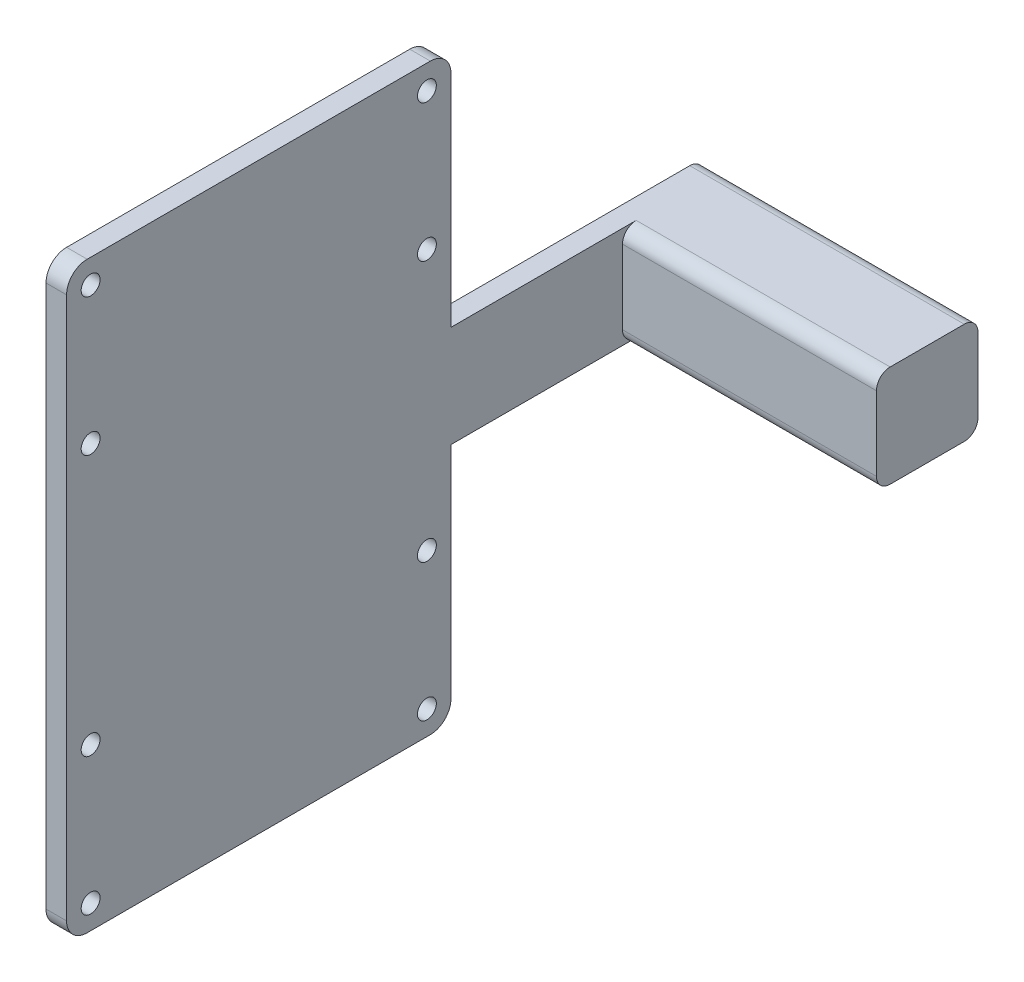
ISO-10303-21;
HEADER;
FILE_DESCRIPTION(('STEP AP214'),'2;1');
FILE_NAME('part.step','',(''),(''),'','','');
FILE_SCHEMA(('AUTOMOTIVE_DESIGN { 1 0 10303 214 1 1 1 1 }'));
ENDSEC;
DATA;
#1=APPLICATION_CONTEXT('core data for automotive mechanical design processes');
#2=APPLICATION_PROTOCOL_DEFINITION('international standard','automotive_design',2000,#1);
#3=PRODUCT_CONTEXT('',#1,'mechanical');
#4=PRODUCT('Part','Part','',(#3));
#5=PRODUCT_RELATED_PRODUCT_CATEGORY('part','',(#4));
#6=PRODUCT_DEFINITION_FORMATION('','',#4);
#7=PRODUCT_DEFINITION_CONTEXT('part definition',#1,'design');
#8=PRODUCT_DEFINITION('design','',#6,#7);
#9=PRODUCT_DEFINITION_SHAPE('','',#8);
#10=(LENGTH_UNIT() NAMED_UNIT(*) SI_UNIT(.MILLI.,.METRE.));
#11=(NAMED_UNIT(*) PLANE_ANGLE_UNIT() SI_UNIT($,.RADIAN.));
#12=(NAMED_UNIT(*) SI_UNIT($,.STERADIAN.) SOLID_ANGLE_UNIT());
#13=UNCERTAINTY_MEASURE_WITH_UNIT(LENGTH_MEASURE(1.E-05),#10,'distance_accuracy_value','');
#14=(GEOMETRIC_REPRESENTATION_CONTEXT(3) GLOBAL_UNCERTAINTY_ASSIGNED_CONTEXT((#13)) GLOBAL_UNIT_ASSIGNED_CONTEXT((#10,
#11,#12)) REPRESENTATION_CONTEXT('',''));
#15=CARTESIAN_POINT('',(0.,0.,0.));
#16=DIRECTION('',(0.,0.,1.));
#17=DIRECTION('',(1.,0.,0.));
#18=AXIS2_PLACEMENT_3D('',#15,#16,#17);
#19=CARTESIAN_POINT('',(-20.,-7.4,14.8));
#20=DIRECTION('',(1.,0.,0.));
#21=DIRECTION('',(0.,0.,-1.));
#22=AXIS2_PLACEMENT_3D('',#19,#20,#21);
#23=PLANE('',#22);
#24=CARTESIAN_POINT('',(-20.,19.,92.3));
#25=DIRECTION('',(1.,0.,0.));
#26=DIRECTION('',(0.,0.,-1.));
#27=AXIS2_PLACEMENT_3D('',#24,#25,#26);
#28=CIRCLE('',#27,1.375);
#29=CARTESIAN_POINT('',(-20.,19.,90.925));
#30=VERTEX_POINT('',#29);
#31=EDGE_CURVE('E373',#30,#30,#28,.F.);
#32=ORIENTED_EDGE('',*,*,#31,.F.);
#33=EDGE_LOOP('',(#32));
#34=FACE_BOUND('',#33,.T.);
#35=CARTESIAN_POINT('',(-20.,19.,43.3));
#36=DIRECTION('',(1.,0.,0.));
#37=DIRECTION('',(0.,0.,-1.));
#38=AXIS2_PLACEMENT_3D('',#35,#36,#37);
#39=CIRCLE('',#38,1.375);
#40=CARTESIAN_POINT('',(-20.,19.,41.925));
#41=VERTEX_POINT('',#40);
#42=EDGE_CURVE('E380',#41,#41,#39,.F.);
#43=ORIENTED_EDGE('',*,*,#42,.F.);
#44=EDGE_LOOP('',(#43));
#45=FACE_BOUND('',#44,.T.);
#46=CARTESIAN_POINT('',(-20.,-39.,43.3));
#47=DIRECTION('',(1.,0.,0.));
#48=DIRECTION('',(0.,0.,-1.));
#49=AXIS2_PLACEMENT_3D('',#46,#47,#48);
#50=CIRCLE('',#49,1.375);
#51=CARTESIAN_POINT('',(-20.,-39.,41.925));
#52=VERTEX_POINT('',#51);
#53=EDGE_CURVE('E383',#52,#52,#50,.F.);
#54=ORIENTED_EDGE('',*,*,#53,.F.);
#55=EDGE_LOOP('',(#54));
#56=FACE_BOUND('',#55,.T.);
#57=CARTESIAN_POINT('',(-20.,-39.,92.3));
#58=DIRECTION('',(1.,0.,0.));
#59=DIRECTION('',(0.,0.,-1.));
#60=AXIS2_PLACEMENT_3D('',#57,#58,#59);
#61=CIRCLE('',#60,1.375);
#62=CARTESIAN_POINT('',(-20.,-39.,90.925));
#63=VERTEX_POINT('',#62);
#64=EDGE_CURVE('E386',#63,#63,#61,.F.);
#65=ORIENTED_EDGE('',*,*,#64,.F.);
#66=EDGE_LOOP('',(#65));
#67=FACE_BOUND('',#66,.T.);
#68=CARTESIAN_POINT('',(-20.,-19.,92.3));
#69=DIRECTION('',(1.,0.,0.));
#70=DIRECTION('',(0.,0.,-1.));
#71=AXIS2_PLACEMENT_3D('',#68,#69,#70);
#72=CIRCLE('',#71,1.375);
#73=CARTESIAN_POINT('',(-20.,-19.,90.925));
#74=VERTEX_POINT('',#73);
#75=EDGE_CURVE('E353',#74,#74,#72,.T.);
#76=ORIENTED_EDGE('',*,*,#75,.T.);
#77=EDGE_LOOP('',(#76));
#78=FACE_BOUND('',#77,.T.);
#79=CARTESIAN_POINT('',(-20.,-19.,43.3));
#80=DIRECTION('',(1.,0.,0.));
#81=DIRECTION('',(0.,0.,-1.));
#82=AXIS2_PLACEMENT_3D('',#79,#80,#81);
#83=CIRCLE('',#82,1.375);
#84=CARTESIAN_POINT('',(-20.,-19.,41.925));
#85=VERTEX_POINT('',#84);
#86=EDGE_CURVE('E356',#85,#85,#83,.T.);
#87=ORIENTED_EDGE('',*,*,#86,.T.);
#88=EDGE_LOOP('',(#87));
#89=FACE_BOUND('',#88,.T.);
#90=CARTESIAN_POINT('',(-20.,39.,43.3));
#91=DIRECTION('',(1.,0.,0.));
#92=DIRECTION('',(0.,0.,-1.));
#93=AXIS2_PLACEMENT_3D('',#90,#91,#92);
#94=CIRCLE('',#93,1.375);
#95=CARTESIAN_POINT('',(-20.,39.,41.925));
#96=VERTEX_POINT('',#95);
#97=EDGE_CURVE('E359',#96,#96,#94,.T.);
#98=ORIENTED_EDGE('',*,*,#97,.T.);
#99=EDGE_LOOP('',(#98));
#100=FACE_BOUND('',#99,.T.);
#101=CARTESIAN_POINT('',(-20.,39.,92.3));
#102=DIRECTION('',(1.,0.,0.));
#103=DIRECTION('',(0.,0.,-1.));
#104=AXIS2_PLACEMENT_3D('',#101,#102,#103);
#105=CIRCLE('',#104,1.375);
#106=CARTESIAN_POINT('',(-20.,39.,90.925));
#107=VERTEX_POINT('',#106);
#108=EDGE_CURVE('E362',#107,#107,#105,.T.);
#109=ORIENTED_EDGE('',*,*,#108,.T.);
#110=EDGE_LOOP('',(#109));
#111=FACE_BOUND('',#110,.T.);
#112=DIRECTION('',(0.,0.,-1.));
#113=VECTOR('',#112,1.);
#114=CARTESIAN_POINT('',(-20.,7.4,14.8));
#115=LINE('',#114,#113);
#116=CARTESIAN_POINT('',(-20.,7.4,39.8));
#117=VERTEX_POINT('',#116);
#118=CARTESIAN_POINT('',(-20.,7.4,2.));
#119=VERTEX_POINT('',#118);
#120=EDGE_CURVE('E161',#117,#119,#115,.T.);
#121=ORIENTED_EDGE('',*,*,#120,.T.);
#122=CARTESIAN_POINT('',(-20.,5.4,2.));
#123=DIRECTION('',(1.,0.,0.));
#124=DIRECTION('',(0.,0.,-1.));
#125=AXIS2_PLACEMENT_3D('',#122,#123,#124);
#126=CIRCLE('',#125,2.);
#127=CARTESIAN_POINT('',(-20.,5.4,0.));
#128=VERTEX_POINT('',#127);
#129=EDGE_CURVE('E57',#119,#128,#126,.F.);
#130=ORIENTED_EDGE('',*,*,#129,.T.);
#131=DIRECTION('',(0.,-1.,0.));
#132=VECTOR('',#131,1.);
#133=CARTESIAN_POINT('',(-20.,-7.4,0.));
#134=LINE('',#133,#132);
#135=CARTESIAN_POINT('',(-20.,-5.4,0.));
#136=VERTEX_POINT('',#135);
#137=EDGE_CURVE('E198',#128,#136,#134,.T.);
#138=ORIENTED_EDGE('',*,*,#137,.T.);
#139=CARTESIAN_POINT('',(-20.,-5.4,2.));
#140=DIRECTION('',(1.,0.,0.));
#141=DIRECTION('',(0.,0.,-1.));
#142=AXIS2_PLACEMENT_3D('',#139,#140,#141);
#143=CIRCLE('',#142,2.);
#144=CARTESIAN_POINT('',(-20.,-7.4,2.));
#145=VERTEX_POINT('',#144);
#146=EDGE_CURVE('E270',#136,#145,#143,.F.);
#147=ORIENTED_EDGE('',*,*,#146,.T.);
#148=DIRECTION('',(0.,0.,-1.));
#149=VECTOR('',#148,1.);
#150=CARTESIAN_POINT('',(-20.,-7.4,14.8));
#151=LINE('',#150,#149);
#152=CARTESIAN_POINT('',(-20.,-7.4,39.8));
#153=VERTEX_POINT('',#152);
#154=EDGE_CURVE('E209',#153,#145,#151,.T.);
#155=ORIENTED_EDGE('',*,*,#154,.F.);
#156=DIRECTION('',(0.,-1.,0.));
#157=VECTOR('',#156,1.);
#158=CARTESIAN_POINT('',(-20.,-42.5,39.8));
#159=LINE('',#158,#157);
#160=CARTESIAN_POINT('',(-20.,-39.5,39.8));
#161=VERTEX_POINT('',#160);
#162=EDGE_CURVE('E168',#153,#161,#159,.T.);
#163=ORIENTED_EDGE('',*,*,#162,.T.);
#164=CARTESIAN_POINT('',(-20.,-39.5,42.8));
#165=DIRECTION('',(1.,0.,0.));
#166=DIRECTION('',(0.,0.,-1.));
#167=AXIS2_PLACEMENT_3D('',#164,#165,#166);
#168=CIRCLE('',#167,3.);
#169=CARTESIAN_POINT('',(-20.,-42.5,42.8));
#170=VERTEX_POINT('',#169);
#171=EDGE_CURVE('E232',#161,#170,#168,.F.);
#172=ORIENTED_EDGE('',*,*,#171,.T.);
#173=DIRECTION('',(0.,0.,-1.));
#174=VECTOR('',#173,1.);
#175=CARTESIAN_POINT('',(-20.,-42.5,95.8));
#176=LINE('',#175,#174);
#177=CARTESIAN_POINT('',(-20.,-42.5,92.8));
#178=VERTEX_POINT('',#177);
#179=EDGE_CURVE('E195',#178,#170,#176,.T.);
#180=ORIENTED_EDGE('',*,*,#179,.F.);
#181=CARTESIAN_POINT('',(-20.,-39.5,92.8));
#182=DIRECTION('',(1.,0.,0.));
#183=DIRECTION('',(0.,0.,-1.));
#184=AXIS2_PLACEMENT_3D('',#181,#182,#183);
#185=CIRCLE('',#184,3.);
#186=CARTESIAN_POINT('',(-20.,-39.5,95.8));
#187=VERTEX_POINT('',#186);
#188=EDGE_CURVE('E230',#178,#187,#185,.F.);
#189=ORIENTED_EDGE('',*,*,#188,.T.);
#190=DIRECTION('',(0.,-1.,0.));
#191=VECTOR('',#190,1.);
#192=CARTESIAN_POINT('',(-20.,-42.5,95.8));
#193=LINE('',#192,#191);
#194=CARTESIAN_POINT('',(-20.,39.5,95.8));
#195=VERTEX_POINT('',#194);
#196=EDGE_CURVE('E328',#195,#187,#193,.T.);
#197=ORIENTED_EDGE('',*,*,#196,.F.);
#198=CARTESIAN_POINT('',(-20.,39.5,92.8));
#199=DIRECTION('',(1.,0.,0.));
#200=DIRECTION('',(0.,0.,-1.));
#201=AXIS2_PLACEMENT_3D('',#198,#199,#200);
#202=CIRCLE('',#201,3.);
#203=CARTESIAN_POINT('',(-20.,42.5,92.8));
#204=VERTEX_POINT('',#203);
#205=EDGE_CURVE('E227',#195,#204,#202,.F.);
#206=ORIENTED_EDGE('',*,*,#205,.T.);
#207=DIRECTION('',(0.,0.,-1.));
#208=VECTOR('',#207,1.);
#209=CARTESIAN_POINT('',(-20.,42.5,95.8));
#210=LINE('',#209,#208);
#211=CARTESIAN_POINT('',(-20.,42.5,42.8));
#212=VERTEX_POINT('',#211);
#213=EDGE_CURVE('E319',#204,#212,#210,.T.);
#214=ORIENTED_EDGE('',*,*,#213,.T.);
#215=CARTESIAN_POINT('',(-20.,39.5,42.8));
#216=DIRECTION('',(1.,0.,0.));
#217=DIRECTION('',(0.,0.,-1.));
#218=AXIS2_PLACEMENT_3D('',#215,#216,#217);
#219=CIRCLE('',#218,3.);
#220=CARTESIAN_POINT('',(-20.,39.5,39.8));
#221=VERTEX_POINT('',#220);
#222=EDGE_CURVE('E163',#212,#221,#219,.F.);
#223=ORIENTED_EDGE('',*,*,#222,.T.);
#224=EDGE_CURVE('E159',#221,#117,#159,.T.);
#225=ORIENTED_EDGE('',*,*,#224,.T.);
#226=EDGE_LOOP('',(#121,#130,#138,#147,#155,#163,#172,#180,#189,#197,#206,#214,#223,#225));
#227=FACE_BOUND('',#226,.T.);
#228=ADVANCED_FACE('F35',(#34,#45,#56,#67,#78,#89,#100,#111,#227),#23,.F.);
#229=CARTESIAN_POINT('',(20.,-7.4,14.8));
#230=DIRECTION('',(0.,1.,0.));
#231=DIRECTION('',(-1.,0.,0.));
#232=AXIS2_PLACEMENT_3D('',#229,#230,#231);
#233=PLANE('',#232);
#234=DIRECTION('',(0.,0.,-1.));
#235=VECTOR('',#234,1.);
#236=CARTESIAN_POINT('',(20.,-7.4,14.8));
#237=LINE('',#236,#235);
#238=CARTESIAN_POINT('',(20.,-7.4,12.8));
#239=VERTEX_POINT('',#238);
#240=CARTESIAN_POINT('',(20.,-7.4,2.));
#241=VERTEX_POINT('',#240);
#242=EDGE_CURVE('E206',#239,#241,#237,.T.);
#243=ORIENTED_EDGE('',*,*,#242,.F.);
#244=DIRECTION('',(1.,0.,0.));
#245=VECTOR('',#244,1.);
#246=CARTESIAN_POINT('',(-17.,-7.4,12.8));
#247=LINE('',#246,#245);
#248=CARTESIAN_POINT('',(-17.,-7.4,12.8));
#249=VERTEX_POINT('',#248);
#250=EDGE_CURVE('E264',#239,#249,#247,.F.);
#251=ORIENTED_EDGE('',*,*,#250,.T.);
#252=DIRECTION('',(0.,0.,-1.));
#253=VECTOR('',#252,1.);
#254=CARTESIAN_POINT('',(-17.,-7.4,39.8));
#255=LINE('',#254,#253);
#256=CARTESIAN_POINT('',(-17.,-7.4,39.8));
#257=VERTEX_POINT('',#256);
#258=EDGE_CURVE('E187',#257,#249,#255,.T.);
#259=ORIENTED_EDGE('',*,*,#258,.F.);
#260=DIRECTION('',(1.,0.,0.));
#261=VECTOR('',#260,1.);
#262=CARTESIAN_POINT('',(-20.,-7.4,39.8));
#263=LINE('',#262,#261);
#264=EDGE_CURVE('E185',#153,#257,#263,.T.);
#265=ORIENTED_EDGE('',*,*,#264,.F.);
#266=ORIENTED_EDGE('',*,*,#154,.T.);
#267=DIRECTION('',(1.,0.,0.));
#268=VECTOR('',#267,1.);
#269=CARTESIAN_POINT('',(20.,-7.4,2.));
#270=LINE('',#269,#268);
#271=EDGE_CURVE('E261',#145,#241,#270,.T.);
#272=ORIENTED_EDGE('',*,*,#271,.T.);
#273=EDGE_LOOP('',(#243,#251,#259,#265,#266,#272));
#274=FACE_BOUND('',#273,.T.);
#275=ADVANCED_FACE('F293',(#274),#233,.F.);
#276=CARTESIAN_POINT('',(20.,-7.4,14.8));
#277=DIRECTION('',(-1.,0.,0.));
#278=DIRECTION('',(0.,0.,1.));
#279=AXIS2_PLACEMENT_3D('',#276,#277,#278);
#280=PLANE('',#279);
#281=DIRECTION('',(0.,1.,0.));
#282=VECTOR('',#281,1.);
#283=CARTESIAN_POINT('',(20.,-7.4,14.8));
#284=LINE('',#283,#282);
#285=CARTESIAN_POINT('',(20.,-5.4,14.8));
#286=VERTEX_POINT('',#285);
#287=CARTESIAN_POINT('',(20.,5.4,14.8));
#288=VERTEX_POINT('',#287);
#289=EDGE_CURVE('E180',#286,#288,#284,.T.);
#290=ORIENTED_EDGE('',*,*,#289,.F.);
#291=CARTESIAN_POINT('',(20.,-5.4,12.8));
#292=DIRECTION('',(-1.,0.,0.));
#293=DIRECTION('',(0.,0.,1.));
#294=AXIS2_PLACEMENT_3D('',#291,#292,#293);
#295=CIRCLE('',#294,2.);
#296=EDGE_CURVE('E259',#286,#239,#295,.F.);
#297=ORIENTED_EDGE('',*,*,#296,.T.);
#298=ORIENTED_EDGE('',*,*,#242,.T.);
#299=CARTESIAN_POINT('',(20.,-5.4,2.));
#300=DIRECTION('',(-1.,0.,0.));
#301=DIRECTION('',(0.,0.,1.));
#302=AXIS2_PLACEMENT_3D('',#299,#300,#301);
#303=CIRCLE('',#302,2.);
#304=CARTESIAN_POINT('',(20.,-5.4,0.));
#305=VERTEX_POINT('',#304);
#306=EDGE_CURVE('E253',#241,#305,#303,.F.);
#307=ORIENTED_EDGE('',*,*,#306,.T.);
#308=DIRECTION('',(0.,1.,0.));
#309=VECTOR('',#308,1.);
#310=CARTESIAN_POINT('',(20.,-7.4,0.));
#311=LINE('',#310,#309);
#312=CARTESIAN_POINT('',(20.,5.4,0.));
#313=VERTEX_POINT('',#312);
#314=EDGE_CURVE('E201',#305,#313,#311,.T.);
#315=ORIENTED_EDGE('',*,*,#314,.T.);
#316=CARTESIAN_POINT('',(20.,5.4,2.));
#317=DIRECTION('',(-1.,0.,0.));
#318=DIRECTION('',(0.,0.,1.));
#319=AXIS2_PLACEMENT_3D('',#316,#317,#318);
#320=CIRCLE('',#319,2.);
#321=CARTESIAN_POINT('',(20.,7.4,2.));
#322=VERTEX_POINT('',#321);
#323=EDGE_CURVE('E255',#313,#322,#320,.F.);
#324=ORIENTED_EDGE('',*,*,#323,.T.);
#325=DIRECTION('',(0.,0.,-1.));
#326=VECTOR('',#325,1.);
#327=CARTESIAN_POINT('',(20.,7.4,14.8));
#328=LINE('',#327,#326);
#329=CARTESIAN_POINT('',(20.,7.4,12.8));
#330=VERTEX_POINT('',#329);
#331=EDGE_CURVE('E179',#330,#322,#328,.T.);
#332=ORIENTED_EDGE('',*,*,#331,.F.);
#333=CARTESIAN_POINT('',(20.,5.4,12.8));
#334=DIRECTION('',(-1.,0.,0.));
#335=DIRECTION('',(0.,0.,1.));
#336=AXIS2_PLACEMENT_3D('',#333,#334,#335);
#337=CIRCLE('',#336,2.);
#338=EDGE_CURVE('E257',#330,#288,#337,.F.);
#339=ORIENTED_EDGE('',*,*,#338,.T.);
#340=EDGE_LOOP('',(#290,#297,#298,#307,#315,#324,#332,#339));
#341=FACE_BOUND('',#340,.T.);
#342=ADVANCED_FACE('F291',(#341),#280,.F.);
#343=CARTESIAN_POINT('',(20.,7.4,14.8));
#344=DIRECTION('',(0.,-1.,0.));
#345=DIRECTION('',(1.,0.,0.));
#346=AXIS2_PLACEMENT_3D('',#343,#344,#345);
#347=PLANE('',#346);
#348=DIRECTION('',(0.,0.,-1.));
#349=VECTOR('',#348,1.);
#350=CARTESIAN_POINT('',(-17.,7.4,39.8));
#351=LINE('',#350,#349);
#352=CARTESIAN_POINT('',(-17.,7.4,39.8));
#353=VERTEX_POINT('',#352);
#354=CARTESIAN_POINT('',(-17.,7.4,12.8));
#355=VERTEX_POINT('',#354);
#356=EDGE_CURVE('E184',#353,#355,#351,.T.);
#357=ORIENTED_EDGE('',*,*,#356,.T.);
#358=DIRECTION('',(-1.,0.,0.));
#359=VECTOR('',#358,1.);
#360=CARTESIAN_POINT('',(20.,7.4,12.8));
#361=LINE('',#360,#359);
#362=EDGE_CURVE('E268',#355,#330,#361,.F.);
#363=ORIENTED_EDGE('',*,*,#362,.T.);
#364=ORIENTED_EDGE('',*,*,#331,.T.);
#365=DIRECTION('',(-1.,0.,0.));
#366=VECTOR('',#365,1.);
#367=CARTESIAN_POINT('',(20.,7.4,2.));
#368=LINE('',#367,#366);
#369=EDGE_CURVE('E178',#322,#119,#368,.T.);
#370=ORIENTED_EDGE('',*,*,#369,.T.);
#371=ORIENTED_EDGE('',*,*,#120,.F.);
#372=DIRECTION('',(-1.,0.,0.));
#373=VECTOR('',#372,1.);
#374=CARTESIAN_POINT('',(-20.,7.4,39.8));
#375=LINE('',#374,#373);
#376=EDGE_CURVE('E174',#353,#117,#375,.T.);
#377=ORIENTED_EDGE('',*,*,#376,.F.);
#378=EDGE_LOOP('',(#357,#363,#364,#370,#371,#377));
#379=FACE_BOUND('',#378,.T.);
#380=ADVANCED_FACE('F173',(#379),#347,.F.);
#381=CARTESIAN_POINT('',(0.,0.,14.8));
#382=DIRECTION('',(0.,0.,1.));
#383=DIRECTION('',(1.,0.,0.));
#384=AXIS2_PLACEMENT_3D('',#381,#382,#383);
#385=PLANE('',#384);
#386=DIRECTION('',(0.,1.,0.));
#387=VECTOR('',#386,1.);
#388=CARTESIAN_POINT('',(-17.,7.4,14.8));
#389=LINE('',#388,#387);
#390=CARTESIAN_POINT('',(-17.,-5.4,14.8));
#391=VERTEX_POINT('',#390);
#392=CARTESIAN_POINT('',(-17.,5.4,14.8));
#393=VERTEX_POINT('',#392);
#394=EDGE_CURVE('E190',#391,#393,#389,.T.);
#395=ORIENTED_EDGE('',*,*,#394,.F.);
#396=DIRECTION('',(1.,0.,0.));
#397=VECTOR('',#396,1.);
#398=CARTESIAN_POINT('',(20.,-5.4,14.8));
#399=LINE('',#398,#397);
#400=EDGE_CURVE('E250',#391,#286,#399,.T.);
#401=ORIENTED_EDGE('',*,*,#400,.T.);
#402=ORIENTED_EDGE('',*,*,#289,.T.);
#403=DIRECTION('',(-1.,0.,0.));
#404=VECTOR('',#403,1.);
#405=CARTESIAN_POINT('',(-17.,5.4,14.8));
#406=LINE('',#405,#404);
#407=EDGE_CURVE('E247',#288,#393,#406,.T.);
#408=ORIENTED_EDGE('',*,*,#407,.T.);
#409=EDGE_LOOP('',(#395,#401,#402,#408));
#410=FACE_BOUND('',#409,.T.);
#411=ADVANCED_FACE('F285',(#410),#385,.T.);
#412=CARTESIAN_POINT('',(0.,0.,0.));
#413=DIRECTION('',(0.,0.,1.));
#414=DIRECTION('',(1.,0.,0.));
#415=AXIS2_PLACEMENT_3D('',#412,#413,#414);
#416=PLANE('',#415);
#417=ORIENTED_EDGE('',*,*,#137,.F.);
#418=DIRECTION('',(-1.,0.,0.));
#419=VECTOR('',#418,1.);
#420=CARTESIAN_POINT('',(0.,5.4,0.));
#421=LINE('',#420,#419);
#422=EDGE_CURVE('E274',#128,#313,#421,.F.);
#423=ORIENTED_EDGE('',*,*,#422,.T.);
#424=ORIENTED_EDGE('',*,*,#314,.F.);
#425=DIRECTION('',(1.,0.,0.));
#426=VECTOR('',#425,1.);
#427=CARTESIAN_POINT('',(0.,-5.4,0.));
#428=LINE('',#427,#426);
#429=EDGE_CURVE('E50',#305,#136,#428,.F.);
#430=ORIENTED_EDGE('',*,*,#429,.T.);
#431=EDGE_LOOP('',(#417,#423,#424,#430));
#432=FACE_BOUND('',#431,.T.);
#433=ADVANCED_FACE('F299',(#432),#416,.F.);
#434=CARTESIAN_POINT('',(-17.,7.4,39.8));
#435=DIRECTION('',(-1.,0.,0.));
#436=DIRECTION('',(0.,-1.,0.));
#437=AXIS2_PLACEMENT_3D('',#434,#435,#436);
#438=PLANE('',#437);
#439=CARTESIAN_POINT('',(-17.,19.,92.3));
#440=DIRECTION('',(-1.,0.,0.));
#441=DIRECTION('',(0.,-1.,0.));
#442=AXIS2_PLACEMENT_3D('',#439,#440,#441);
#443=CIRCLE('',#442,1.375);
#444=CARTESIAN_POINT('',(-17.,17.625,92.3));
#445=VERTEX_POINT('',#444);
#446=EDGE_CURVE('E393',#445,#445,#443,.T.);
#447=ORIENTED_EDGE('',*,*,#446,.T.);
#448=EDGE_LOOP('',(#447));
#449=FACE_BOUND('',#448,.T.);
#450=CARTESIAN_POINT('',(-17.,19.,43.3));
#451=DIRECTION('',(-1.,0.,0.));
#452=DIRECTION('',(0.,-1.,0.));
#453=AXIS2_PLACEMENT_3D('',#450,#451,#452);
#454=CIRCLE('',#453,1.375);
#455=CARTESIAN_POINT('',(-17.,17.625,43.3));
#456=VERTEX_POINT('',#455);
#457=EDGE_CURVE('E396',#456,#456,#454,.T.);
#458=ORIENTED_EDGE('',*,*,#457,.T.);
#459=EDGE_LOOP('',(#458));
#460=FACE_BOUND('',#459,.T.);
#461=CARTESIAN_POINT('',(-17.,-39.,43.3));
#462=DIRECTION('',(-1.,0.,0.));
#463=DIRECTION('',(0.,-1.,0.));
#464=AXIS2_PLACEMENT_3D('',#461,#462,#463);
#465=CIRCLE('',#464,1.375);
#466=CARTESIAN_POINT('',(-17.,-40.375,43.3));
#467=VERTEX_POINT('',#466);
#468=EDGE_CURVE('E392',#467,#467,#465,.T.);
#469=ORIENTED_EDGE('',*,*,#468,.T.);
#470=EDGE_LOOP('',(#469));
#471=FACE_BOUND('',#470,.T.);
#472=CARTESIAN_POINT('',(-17.,-39.,92.3));
#473=DIRECTION('',(-1.,0.,0.));
#474=DIRECTION('',(0.,-1.,0.));
#475=AXIS2_PLACEMENT_3D('',#472,#473,#474);
#476=CIRCLE('',#475,1.375);
#477=CARTESIAN_POINT('',(-17.,-40.375,92.3));
#478=VERTEX_POINT('',#477);
#479=EDGE_CURVE('E389',#478,#478,#476,.T.);
#480=ORIENTED_EDGE('',*,*,#479,.T.);
#481=EDGE_LOOP('',(#480));
#482=FACE_BOUND('',#481,.T.);
#483=CARTESIAN_POINT('',(-17.,-19.,92.3));
#484=DIRECTION('',(1.,0.,0.));
#485=DIRECTION('',(0.,1.,0.));
#486=AXIS2_PLACEMENT_3D('',#483,#484,#485);
#487=CIRCLE('',#486,1.375);
#488=CARTESIAN_POINT('',(-17.,-17.625,92.3));
#489=VERTEX_POINT('',#488);
#490=EDGE_CURVE('E369',#489,#489,#487,.T.);
#491=ORIENTED_EDGE('',*,*,#490,.F.);
#492=EDGE_LOOP('',(#491));
#493=FACE_BOUND('',#492,.T.);
#494=CARTESIAN_POINT('',(-17.,-19.,43.3));
#495=DIRECTION('',(1.,0.,0.));
#496=DIRECTION('',(0.,1.,0.));
#497=AXIS2_PLACEMENT_3D('',#494,#495,#496);
#498=CIRCLE('',#497,1.375);
#499=CARTESIAN_POINT('',(-17.,-17.625,43.3));
#500=VERTEX_POINT('',#499);
#501=EDGE_CURVE('E372',#500,#500,#498,.T.);
#502=ORIENTED_EDGE('',*,*,#501,.F.);
#503=EDGE_LOOP('',(#502));
#504=FACE_BOUND('',#503,.T.);
#505=CARTESIAN_POINT('',(-17.,39.,43.3));
#506=DIRECTION('',(1.,0.,0.));
#507=DIRECTION('',(0.,1.,0.));
#508=AXIS2_PLACEMENT_3D('',#505,#506,#507);
#509=CIRCLE('',#508,1.375);
#510=CARTESIAN_POINT('',(-17.,40.375,43.3));
#511=VERTEX_POINT('',#510);
#512=EDGE_CURVE('E368',#511,#511,#509,.T.);
#513=ORIENTED_EDGE('',*,*,#512,.F.);
#514=EDGE_LOOP('',(#513));
#515=FACE_BOUND('',#514,.T.);
#516=CARTESIAN_POINT('',(-17.,39.,92.3));
#517=DIRECTION('',(1.,0.,0.));
#518=DIRECTION('',(0.,1.,0.));
#519=AXIS2_PLACEMENT_3D('',#516,#517,#518);
#520=CIRCLE('',#519,1.375);
#521=CARTESIAN_POINT('',(-17.,40.375,92.3));
#522=VERTEX_POINT('',#521);
#523=EDGE_CURVE('E365',#522,#522,#520,.T.);
#524=ORIENTED_EDGE('',*,*,#523,.F.);
#525=EDGE_LOOP('',(#524));
#526=FACE_BOUND('',#525,.T.);
#527=DIRECTION('',(0.,0.,-1.));
#528=VECTOR('',#527,1.);
#529=CARTESIAN_POINT('',(-17.,-42.5,95.8));
#530=LINE('',#529,#528);
#531=CARTESIAN_POINT('',(-17.,-42.5,92.8));
#532=VERTEX_POINT('',#531);
#533=CARTESIAN_POINT('',(-17.,-42.5,42.8));
#534=VERTEX_POINT('',#533);
#535=EDGE_CURVE('E325',#532,#534,#530,.T.);
#536=ORIENTED_EDGE('',*,*,#535,.T.);
#537=CARTESIAN_POINT('',(-17.,-39.5,42.8));
#538=DIRECTION('',(-1.,0.,0.));
#539=DIRECTION('',(0.,-1.,0.));
#540=AXIS2_PLACEMENT_3D('',#537,#538,#539);
#541=CIRCLE('',#540,3.);
#542=CARTESIAN_POINT('',(-17.,-39.5,39.8));
#543=VERTEX_POINT('',#542);
#544=EDGE_CURVE('E223',#534,#543,#541,.F.);
#545=ORIENTED_EDGE('',*,*,#544,.T.);
#546=DIRECTION('',(0.,1.,0.));
#547=VECTOR('',#546,1.);
#548=CARTESIAN_POINT('',(-17.,-42.5,39.8));
#549=LINE('',#548,#547);
#550=EDGE_CURVE('E311',#543,#257,#549,.T.);
#551=ORIENTED_EDGE('',*,*,#550,.T.);
#552=ORIENTED_EDGE('',*,*,#258,.T.);
#553=CARTESIAN_POINT('',(-17.,-5.4,12.8));
#554=DIRECTION('',(-1.,0.,0.));
#555=DIRECTION('',(0.,-1.,0.));
#556=AXIS2_PLACEMENT_3D('',#553,#554,#555);
#557=CIRCLE('',#556,2.);
#558=EDGE_CURVE('E43',#249,#391,#557,.T.);
#559=ORIENTED_EDGE('',*,*,#558,.T.);
#560=ORIENTED_EDGE('',*,*,#394,.T.);
#561=CARTESIAN_POINT('',(-17.,5.4,12.8));
#562=DIRECTION('',(-1.,0.,0.));
#563=DIRECTION('',(0.,-1.,0.));
#564=AXIS2_PLACEMENT_3D('',#561,#562,#563);
#565=CIRCLE('',#564,2.);
#566=EDGE_CURVE('E11',#393,#355,#565,.T.);
#567=ORIENTED_EDGE('',*,*,#566,.T.);
#568=ORIENTED_EDGE('',*,*,#356,.F.);
#569=CARTESIAN_POINT('',(-17.,39.5,39.8));
#570=VERTEX_POINT('',#569);
#571=EDGE_CURVE('E167',#353,#570,#549,.T.);
#572=ORIENTED_EDGE('',*,*,#571,.T.);
#573=CARTESIAN_POINT('',(-17.,39.5,42.8));
#574=DIRECTION('',(-1.,0.,0.));
#575=DIRECTION('',(0.,-1.,0.));
#576=AXIS2_PLACEMENT_3D('',#573,#574,#575);
#577=CIRCLE('',#576,3.);
#578=CARTESIAN_POINT('',(-17.,42.5,42.8));
#579=VERTEX_POINT('',#578);
#580=EDGE_CURVE('E219',#570,#579,#577,.F.);
#581=ORIENTED_EDGE('',*,*,#580,.T.);
#582=DIRECTION('',(0.,0.,-1.));
#583=VECTOR('',#582,1.);
#584=CARTESIAN_POINT('',(-17.,42.5,95.8));
#585=LINE('',#584,#583);
#586=CARTESIAN_POINT('',(-17.,42.5,92.8));
#587=VERTEX_POINT('',#586);
#588=EDGE_CURVE('E321',#587,#579,#585,.T.);
#589=ORIENTED_EDGE('',*,*,#588,.F.);
#590=CARTESIAN_POINT('',(-17.,39.5,92.8));
#591=DIRECTION('',(-1.,0.,0.));
#592=DIRECTION('',(0.,-1.,0.));
#593=AXIS2_PLACEMENT_3D('',#590,#591,#592);
#594=CIRCLE('',#593,3.);
#595=CARTESIAN_POINT('',(-17.,39.5,95.8));
#596=VERTEX_POINT('',#595);
#597=EDGE_CURVE('E217',#587,#596,#594,.F.);
#598=ORIENTED_EDGE('',*,*,#597,.T.);
#599=DIRECTION('',(0.,1.,0.));
#600=VECTOR('',#599,1.);
#601=CARTESIAN_POINT('',(-17.,-42.5,95.8));
#602=LINE('',#601,#600);
#603=CARTESIAN_POINT('',(-17.,-39.5,95.8));
#604=VERTEX_POINT('',#603);
#605=EDGE_CURVE('E323',#604,#596,#602,.T.);
#606=ORIENTED_EDGE('',*,*,#605,.F.);
#607=CARTESIAN_POINT('',(-17.,-39.5,92.8));
#608=DIRECTION('',(-1.,0.,0.));
#609=DIRECTION('',(0.,-1.,0.));
#610=AXIS2_PLACEMENT_3D('',#607,#608,#609);
#611=CIRCLE('',#610,3.);
#612=EDGE_CURVE('E221',#604,#532,#611,.F.);
#613=ORIENTED_EDGE('',*,*,#612,.T.);
#614=EDGE_LOOP('',(#536,#545,#551,#552,#559,#560,#567,#568,#572,#581,#589,#598,#606,#613));
#615=FACE_BOUND('',#614,.T.);
#616=ADVANCED_FACE('F279',(#449,#460,#471,#482,#493,#504,#515,#526,#615),#438,.F.);
#617=CARTESIAN_POINT('',(0.,0.,39.8));
#618=DIRECTION('',(0.,0.,-1.));
#619=DIRECTION('',(-1.,0.,0.));
#620=AXIS2_PLACEMENT_3D('',#617,#618,#619);
#621=PLANE('',#620);
#622=ORIENTED_EDGE('',*,*,#550,.F.);
#623=DIRECTION('',(1.,0.,0.));
#624=VECTOR('',#623,1.);
#625=CARTESIAN_POINT('',(-20.,-39.5,39.8));
#626=LINE('',#625,#624);
#627=EDGE_CURVE('E225',#543,#161,#626,.F.);
#628=ORIENTED_EDGE('',*,*,#627,.T.);
#629=ORIENTED_EDGE('',*,*,#162,.F.);
#630=ORIENTED_EDGE('',*,*,#264,.T.);
#631=EDGE_LOOP('',(#622,#628,#629,#630));
#632=FACE_BOUND('',#631,.T.);
#633=ADVANCED_FACE('F345',(#632),#621,.T.);
#634=CARTESIAN_POINT('',(-20.,-42.5,95.8));
#635=DIRECTION('',(0.,1.,0.));
#636=DIRECTION('',(0.,0.,1.));
#637=AXIS2_PLACEMENT_3D('',#634,#635,#636);
#638=PLANE('',#637);
#639=ORIENTED_EDGE('',*,*,#179,.T.);
#640=DIRECTION('',(1.,0.,0.));
#641=VECTOR('',#640,1.);
#642=CARTESIAN_POINT('',(-17.,-42.5,42.8));
#643=LINE('',#642,#641);
#644=EDGE_CURVE('E214',#170,#534,#643,.T.);
#645=ORIENTED_EDGE('',*,*,#644,.T.);
#646=ORIENTED_EDGE('',*,*,#535,.F.);
#647=DIRECTION('',(1.,0.,0.));
#648=VECTOR('',#647,1.);
#649=CARTESIAN_POINT('',(-20.,-42.5,92.8));
#650=LINE('',#649,#648);
#651=EDGE_CURVE('E212',#532,#178,#650,.F.);
#652=ORIENTED_EDGE('',*,*,#651,.T.);
#653=EDGE_LOOP('',(#639,#645,#646,#652));
#654=FACE_BOUND('',#653,.T.);
#655=ADVANCED_FACE('F335',(#654),#638,.F.);
#656=CARTESIAN_POINT('',(-20.,42.5,95.8));
#657=DIRECTION('',(0.,-1.,0.));
#658=DIRECTION('',(0.,0.,-1.));
#659=AXIS2_PLACEMENT_3D('',#656,#657,#658);
#660=PLANE('',#659);
#661=ORIENTED_EDGE('',*,*,#588,.T.);
#662=DIRECTION('',(-1.,0.,0.));
#663=VECTOR('',#662,1.);
#664=CARTESIAN_POINT('',(-20.,42.5,42.8));
#665=LINE('',#664,#663);
#666=EDGE_CURVE('E242',#579,#212,#665,.T.);
#667=ORIENTED_EDGE('',*,*,#666,.T.);
#668=ORIENTED_EDGE('',*,*,#213,.F.);
#669=DIRECTION('',(-1.,0.,0.));
#670=VECTOR('',#669,1.);
#671=CARTESIAN_POINT('',(-20.,42.5,92.8));
#672=LINE('',#671,#670);
#673=EDGE_CURVE('E240',#204,#587,#672,.F.);
#674=ORIENTED_EDGE('',*,*,#673,.T.);
#675=EDGE_LOOP('',(#661,#667,#668,#674));
#676=FACE_BOUND('',#675,.T.);
#677=ADVANCED_FACE('F318',(#676),#660,.F.);
#678=CARTESIAN_POINT('',(0.,0.,95.8));
#679=DIRECTION('',(0.,0.,-1.));
#680=DIRECTION('',(-1.,0.,0.));
#681=AXIS2_PLACEMENT_3D('',#678,#679,#680);
#682=PLANE('',#681);
#683=ORIENTED_EDGE('',*,*,#196,.T.);
#684=DIRECTION('',(1.,0.,0.));
#685=VECTOR('',#684,1.);
#686=CARTESIAN_POINT('',(0.,-39.5,95.8));
#687=LINE('',#686,#685);
#688=EDGE_CURVE('E237',#187,#604,#687,.T.);
#689=ORIENTED_EDGE('',*,*,#688,.T.);
#690=ORIENTED_EDGE('',*,*,#605,.T.);
#691=DIRECTION('',(-1.,0.,0.));
#692=VECTOR('',#691,1.);
#693=CARTESIAN_POINT('',(0.,39.5,95.8));
#694=LINE('',#693,#692);
#695=EDGE_CURVE('E234',#596,#195,#694,.T.);
#696=ORIENTED_EDGE('',*,*,#695,.T.);
#697=EDGE_LOOP('',(#683,#689,#690,#696));
#698=FACE_BOUND('',#697,.T.);
#699=ADVANCED_FACE('F438',(#698),#682,.F.);
#700=ORIENTED_EDGE('',*,*,#224,.F.);
#701=DIRECTION('',(-1.,0.,0.));
#702=VECTOR('',#701,1.);
#703=CARTESIAN_POINT('',(-17.,39.5,39.8));
#704=LINE('',#703,#702);
#705=EDGE_CURVE('E245',#221,#570,#704,.F.);
#706=ORIENTED_EDGE('',*,*,#705,.T.);
#707=ORIENTED_EDGE('',*,*,#571,.F.);
#708=ORIENTED_EDGE('',*,*,#376,.T.);
#709=EDGE_LOOP('',(#700,#706,#707,#708));
#710=FACE_BOUND('',#709,.T.);
#711=ADVANCED_FACE('F182',(#710),#621,.T.);
#712=CARTESIAN_POINT('',(-22.,39.,92.3));
#713=DIRECTION('',(1.,0.,0.));
#714=DIRECTION('',(0.,1.,0.));
#715=AXIS2_PLACEMENT_3D('',#712,#713,#714);
#716=CYLINDRICAL_SURFACE('',#715,1.375);
#717=ORIENTED_EDGE('',*,*,#523,.T.);
#718=EDGE_LOOP('',(#717));
#719=FACE_BOUND('',#718,.T.);
#720=ORIENTED_EDGE('',*,*,#108,.F.);
#721=EDGE_LOOP('',(#720));
#722=FACE_BOUND('',#721,.T.);
#723=ADVANCED_FACE('F426',(#719,#722),#716,.F.);
#724=CARTESIAN_POINT('',(-22.,39.,43.3));
#725=DIRECTION('',(1.,0.,0.));
#726=DIRECTION('',(0.,1.,0.));
#727=AXIS2_PLACEMENT_3D('',#724,#725,#726);
#728=CYLINDRICAL_SURFACE('',#727,1.375);
#729=ORIENTED_EDGE('',*,*,#512,.T.);
#730=EDGE_LOOP('',(#729));
#731=FACE_BOUND('',#730,.T.);
#732=ORIENTED_EDGE('',*,*,#97,.F.);
#733=EDGE_LOOP('',(#732));
#734=FACE_BOUND('',#733,.T.);
#735=ADVANCED_FACE('F428',(#731,#734),#728,.F.);
#736=CARTESIAN_POINT('',(-22.,-19.,43.3));
#737=DIRECTION('',(1.,0.,0.));
#738=DIRECTION('',(0.,1.,0.));
#739=AXIS2_PLACEMENT_3D('',#736,#737,#738);
#740=CYLINDRICAL_SURFACE('',#739,1.375);
#741=ORIENTED_EDGE('',*,*,#501,.T.);
#742=EDGE_LOOP('',(#741));
#743=FACE_BOUND('',#742,.T.);
#744=ORIENTED_EDGE('',*,*,#86,.F.);
#745=EDGE_LOOP('',(#744));
#746=FACE_BOUND('',#745,.T.);
#747=ADVANCED_FACE('F435',(#743,#746),#740,.F.);
#748=CARTESIAN_POINT('',(-22.,-19.,92.3));
#749=DIRECTION('',(1.,0.,0.));
#750=DIRECTION('',(0.,1.,0.));
#751=AXIS2_PLACEMENT_3D('',#748,#749,#750);
#752=CYLINDRICAL_SURFACE('',#751,1.375);
#753=ORIENTED_EDGE('',*,*,#490,.T.);
#754=EDGE_LOOP('',(#753));
#755=FACE_BOUND('',#754,.T.);
#756=ORIENTED_EDGE('',*,*,#75,.F.);
#757=EDGE_LOOP('',(#756));
#758=FACE_BOUND('',#757,.T.);
#759=ADVANCED_FACE('F442',(#755,#758),#752,.F.);
#760=CARTESIAN_POINT('',(-20.,-39.5,42.8));
#761=DIRECTION('',(-1.,0.,0.));
#762=DIRECTION('',(0.,0.,1.));
#763=AXIS2_PLACEMENT_3D('',#760,#761,#762);
#764=CYLINDRICAL_SURFACE('',#763,3.);
#765=ORIENTED_EDGE('',*,*,#171,.F.);
#766=ORIENTED_EDGE('',*,*,#627,.F.);
#767=ORIENTED_EDGE('',*,*,#544,.F.);
#768=ORIENTED_EDGE('',*,*,#644,.F.);
#769=EDGE_LOOP('',(#765,#766,#767,#768));
#770=FACE_BOUND('',#769,.T.);
#771=ADVANCED_FACE('F341',(#770),#764,.T.);
#772=CARTESIAN_POINT('',(0.,-39.5,92.8));
#773=DIRECTION('',(1.,0.,0.));
#774=DIRECTION('',(0.,0.,-1.));
#775=AXIS2_PLACEMENT_3D('',#772,#773,#774);
#776=CYLINDRICAL_SURFACE('',#775,3.);
#777=ORIENTED_EDGE('',*,*,#188,.F.);
#778=ORIENTED_EDGE('',*,*,#651,.F.);
#779=ORIENTED_EDGE('',*,*,#612,.F.);
#780=ORIENTED_EDGE('',*,*,#688,.F.);
#781=EDGE_LOOP('',(#777,#778,#779,#780));
#782=FACE_BOUND('',#781,.T.);
#783=ADVANCED_FACE('F465',(#782),#776,.T.);
#784=CARTESIAN_POINT('',(-20.,39.5,42.8));
#785=DIRECTION('',(1.,0.,0.));
#786=DIRECTION('',(0.,0.,-1.));
#787=AXIS2_PLACEMENT_3D('',#784,#785,#786);
#788=CYLINDRICAL_SURFACE('',#787,3.);
#789=ORIENTED_EDGE('',*,*,#580,.F.);
#790=ORIENTED_EDGE('',*,*,#705,.F.);
#791=ORIENTED_EDGE('',*,*,#222,.F.);
#792=ORIENTED_EDGE('',*,*,#666,.F.);
#793=EDGE_LOOP('',(#789,#790,#791,#792));
#794=FACE_BOUND('',#793,.T.);
#795=ADVANCED_FACE('F315',(#794),#788,.T.);
#796=CARTESIAN_POINT('',(0.,39.5,92.8));
#797=DIRECTION('',(-1.,0.,0.));
#798=DIRECTION('',(0.,0.,1.));
#799=AXIS2_PLACEMENT_3D('',#796,#797,#798);
#800=CYLINDRICAL_SURFACE('',#799,3.);
#801=ORIENTED_EDGE('',*,*,#597,.F.);
#802=ORIENTED_EDGE('',*,*,#673,.F.);
#803=ORIENTED_EDGE('',*,*,#205,.F.);
#804=ORIENTED_EDGE('',*,*,#695,.F.);
#805=EDGE_LOOP('',(#801,#802,#803,#804));
#806=FACE_BOUND('',#805,.T.);
#807=ADVANCED_FACE('F471',(#806),#800,.T.);
#808=CARTESIAN_POINT('',(-22.,-39.,92.3));
#809=DIRECTION('',(1.,0.,0.));
#810=DIRECTION('',(0.,1.,0.));
#811=AXIS2_PLACEMENT_3D('',#808,#809,#810);
#812=CYLINDRICAL_SURFACE('',#811,1.375);
#813=ORIENTED_EDGE('',*,*,#479,.F.);
#814=EDGE_LOOP('',(#813));
#815=FACE_BOUND('',#814,.T.);
#816=ORIENTED_EDGE('',*,*,#64,.T.);
#817=EDGE_LOOP('',(#816));
#818=FACE_BOUND('',#817,.T.);
#819=ADVANCED_FACE('F408',(#815,#818),#812,.F.);
#820=CARTESIAN_POINT('',(-22.,-39.,43.3));
#821=DIRECTION('',(1.,0.,0.));
#822=DIRECTION('',(0.,1.,0.));
#823=AXIS2_PLACEMENT_3D('',#820,#821,#822);
#824=CYLINDRICAL_SURFACE('',#823,1.375);
#825=ORIENTED_EDGE('',*,*,#468,.F.);
#826=EDGE_LOOP('',(#825));
#827=FACE_BOUND('',#826,.T.);
#828=ORIENTED_EDGE('',*,*,#53,.T.);
#829=EDGE_LOOP('',(#828));
#830=FACE_BOUND('',#829,.T.);
#831=ADVANCED_FACE('F404',(#827,#830),#824,.F.);
#832=CARTESIAN_POINT('',(-22.,19.,43.3));
#833=DIRECTION('',(1.,0.,0.));
#834=DIRECTION('',(0.,1.,0.));
#835=AXIS2_PLACEMENT_3D('',#832,#833,#834);
#836=CYLINDRICAL_SURFACE('',#835,1.375);
#837=ORIENTED_EDGE('',*,*,#457,.F.);
#838=EDGE_LOOP('',(#837));
#839=FACE_BOUND('',#838,.T.);
#840=ORIENTED_EDGE('',*,*,#42,.T.);
#841=EDGE_LOOP('',(#840));
#842=FACE_BOUND('',#841,.T.);
#843=ADVANCED_FACE('F407',(#839,#842),#836,.F.);
#844=CARTESIAN_POINT('',(-22.,19.,92.3));
#845=DIRECTION('',(1.,0.,0.));
#846=DIRECTION('',(0.,1.,0.));
#847=AXIS2_PLACEMENT_3D('',#844,#845,#846);
#848=CYLINDRICAL_SURFACE('',#847,1.375);
#849=ORIENTED_EDGE('',*,*,#446,.F.);
#850=EDGE_LOOP('',(#849));
#851=FACE_BOUND('',#850,.T.);
#852=ORIENTED_EDGE('',*,*,#31,.T.);
#853=EDGE_LOOP('',(#852));
#854=FACE_BOUND('',#853,.T.);
#855=ADVANCED_FACE('F477',(#851,#854),#848,.F.);
#856=CARTESIAN_POINT('',(0.,-5.4,12.8));
#857=DIRECTION('',(-1.,0.,0.));
#858=DIRECTION('',(0.,-1.,0.));
#859=AXIS2_PLACEMENT_3D('',#856,#857,#858);
#860=CYLINDRICAL_SURFACE('',#859,2.);
#861=ORIENTED_EDGE('',*,*,#558,.F.);
#862=ORIENTED_EDGE('',*,*,#250,.F.);
#863=ORIENTED_EDGE('',*,*,#296,.F.);
#864=ORIENTED_EDGE('',*,*,#400,.F.);
#865=EDGE_LOOP('',(#861,#862,#863,#864));
#866=FACE_BOUND('',#865,.T.);
#867=ADVANCED_FACE('F288',(#866),#860,.T.);
#868=CARTESIAN_POINT('',(0.,5.4,12.8));
#869=DIRECTION('',(1.,0.,0.));
#870=DIRECTION('',(0.,1.,0.));
#871=AXIS2_PLACEMENT_3D('',#868,#869,#870);
#872=CYLINDRICAL_SURFACE('',#871,2.);
#873=ORIENTED_EDGE('',*,*,#338,.F.);
#874=ORIENTED_EDGE('',*,*,#362,.F.);
#875=ORIENTED_EDGE('',*,*,#566,.F.);
#876=ORIENTED_EDGE('',*,*,#407,.F.);
#877=EDGE_LOOP('',(#873,#874,#875,#876));
#878=FACE_BOUND('',#877,.T.);
#879=ADVANCED_FACE('F307',(#878),#872,.T.);
#880=CARTESIAN_POINT('',(20.,5.4,2.));
#881=DIRECTION('',(-1.,0.,0.));
#882=DIRECTION('',(0.,-1.,0.));
#883=AXIS2_PLACEMENT_3D('',#880,#881,#882);
#884=CYLINDRICAL_SURFACE('',#883,2.);
#885=ORIENTED_EDGE('',*,*,#323,.F.);
#886=ORIENTED_EDGE('',*,*,#422,.F.);
#887=ORIENTED_EDGE('',*,*,#129,.F.);
#888=ORIENTED_EDGE('',*,*,#369,.F.);
#889=EDGE_LOOP('',(#885,#886,#887,#888));
#890=FACE_BOUND('',#889,.T.);
#891=ADVANCED_FACE('F302',(#890),#884,.T.);
#892=CARTESIAN_POINT('',(20.,-5.4,2.));
#893=DIRECTION('',(1.,0.,0.));
#894=DIRECTION('',(0.,1.,0.));
#895=AXIS2_PLACEMENT_3D('',#892,#893,#894);
#896=CYLINDRICAL_SURFACE('',#895,2.);
#897=ORIENTED_EDGE('',*,*,#146,.F.);
#898=ORIENTED_EDGE('',*,*,#429,.F.);
#899=ORIENTED_EDGE('',*,*,#306,.F.);
#900=ORIENTED_EDGE('',*,*,#271,.F.);
#901=EDGE_LOOP('',(#897,#898,#899,#900));
#902=FACE_BOUND('',#901,.T.);
#903=ADVANCED_FACE('F37',(#902),#896,.T.);
#904=CLOSED_SHELL('',(#228,#275,#342,#380,#411,#433,#616,#633,#655,#677,#699,#711,#723,#735,
#747,#759,#771,#783,#795,#807,#819,#831,#843,#855,#867,#879,#891,#903));
#905=MANIFOLD_SOLID_BREP('B2',#904);
#906=ADVANCED_BREP_SHAPE_REPRESENTATION('',(#18,#905),#14);
#907=SHAPE_DEFINITION_REPRESENTATION(#9,#906);
ENDSEC;
END-ISO-10303-21;
